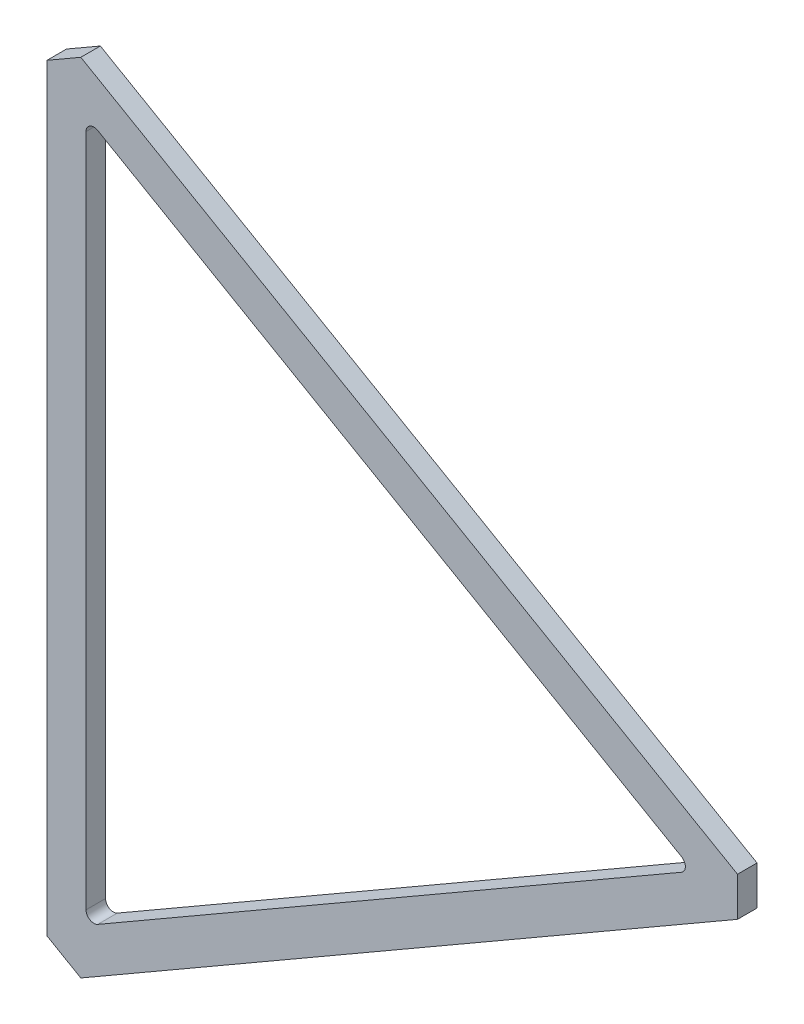
ISO-10303-21;
HEADER;
FILE_DESCRIPTION(('STEP AP214'),'2;1');
FILE_NAME('part.step','',(''),(''),'','','');
FILE_SCHEMA(('AUTOMOTIVE_DESIGN { 1 0 10303 214 1 1 1 1 }'));
ENDSEC;
DATA;
#1=APPLICATION_CONTEXT('core data for automotive mechanical design processes');
#2=APPLICATION_PROTOCOL_DEFINITION('international standard','automotive_design',2000,#1);
#3=PRODUCT_CONTEXT('',#1,'mechanical');
#4=PRODUCT('Part','Part','',(#3));
#5=PRODUCT_RELATED_PRODUCT_CATEGORY('part','',(#4));
#6=PRODUCT_DEFINITION_FORMATION('','',#4);
#7=PRODUCT_DEFINITION_CONTEXT('part definition',#1,'design');
#8=PRODUCT_DEFINITION('design','',#6,#7);
#9=PRODUCT_DEFINITION_SHAPE('','',#8);
#10=(LENGTH_UNIT() NAMED_UNIT(*) SI_UNIT(.MILLI.,.METRE.));
#11=(NAMED_UNIT(*) PLANE_ANGLE_UNIT() SI_UNIT($,.RADIAN.));
#12=(NAMED_UNIT(*) SI_UNIT($,.STERADIAN.) SOLID_ANGLE_UNIT());
#13=UNCERTAINTY_MEASURE_WITH_UNIT(LENGTH_MEASURE(1.E-05),#10,'distance_accuracy_value','');
#14=(GEOMETRIC_REPRESENTATION_CONTEXT(3) GLOBAL_UNCERTAINTY_ASSIGNED_CONTEXT((#13)) GLOBAL_UNIT_ASSIGNED_CONTEXT((#10,
#11,#12)) REPRESENTATION_CONTEXT('',''));
#15=CARTESIAN_POINT('',(0.,0.,0.));
#16=DIRECTION('',(0.,0.,1.));
#17=DIRECTION('',(1.,0.,0.));
#18=AXIS2_PLACEMENT_3D('',#15,#16,#17);
#19=CARTESIAN_POINT('',(0.,0.,-6.35));
#20=DIRECTION('',(0.,0.,1.));
#21=DIRECTION('',(1.,0.,0.));
#22=AXIS2_PLACEMENT_3D('',#19,#20,#21);
#23=PLANE('',#22);
#24=DIRECTION('',(-0.866025403784441,-0.499999999999996,0.));
#25=VECTOR('',#24,1.);
#26=CARTESIAN_POINT('',(-398.132084390221,129.552216057907,-6.35));
#27=LINE('',#26,#25);
#28=CARTESIAN_POINT('',(-398.132084390221,129.552216057907,-6.35));
#29=VERTEX_POINT('',#28);
#30=CARTESIAN_POINT('',(-409.130607018285,123.202216057907,-6.35));
#31=VERTEX_POINT('',#30);
#32=EDGE_CURVE('E179',#29,#31,#27,.T.);
#33=ORIENTED_EDGE('',*,*,#32,.F.);
#34=DIRECTION('',(-0.866025403784437,0.500000000000003,0.));
#35=VECTOR('',#34,1.);
#36=CARTESIAN_POINT('',(-398.132084390221,129.552216057907,-6.35));
#37=LINE('',#36,#35);
#38=CARTESIAN_POINT('',(-184.739586572849,6.35,-6.35));
#39=VERTEX_POINT('',#38);
#40=EDGE_CURVE('E176',#39,#29,#37,.T.);
#41=ORIENTED_EDGE('',*,*,#40,.F.);
#42=DIRECTION('',(0.,1.,0.));
#43=VECTOR('',#42,1.);
#44=CARTESIAN_POINT('',(-184.739586572849,-6.35,-6.35));
#45=LINE('',#44,#43);
#46=CARTESIAN_POINT('',(-184.739586572849,-6.34999999999999,-6.35));
#47=VERTEX_POINT('',#46);
#48=EDGE_CURVE('E171',#47,#39,#45,.T.);
#49=ORIENTED_EDGE('',*,*,#48,.F.);
#50=DIRECTION('',(0.866025403784439,0.5,0.));
#51=VECTOR('',#50,1.);
#52=CARTESIAN_POINT('',(-184.739586572849,-6.35,-6.35));
#53=LINE('',#52,#51);
#54=CARTESIAN_POINT('',(-398.132084390222,-129.552216057907,-6.35));
#55=VERTEX_POINT('',#54);
#56=EDGE_CURVE('E166',#55,#47,#53,.T.);
#57=ORIENTED_EDGE('',*,*,#56,.F.);
#58=DIRECTION('',(0.866025403784441,-0.499999999999996,0.));
#59=VECTOR('',#58,1.);
#60=CARTESIAN_POINT('',(-409.130607018285,-123.202216057906,-6.35));
#61=LINE('',#60,#59);
#62=CARTESIAN_POINT('',(-409.130607018285,-123.202216057906,-6.35));
#63=VERTEX_POINT('',#62);
#64=EDGE_CURVE('E161',#63,#55,#61,.T.);
#65=ORIENTED_EDGE('',*,*,#64,.F.);
#66=DIRECTION('',(0.,1.,0.));
#67=VECTOR('',#66,1.);
#68=CARTESIAN_POINT('',(-409.130607018285,-123.202216057906,-6.35));
#69=LINE('',#68,#67);
#70=EDGE_CURVE('E146',#31,#63,#69,.F.);
#71=ORIENTED_EDGE('',*,*,#70,.F.);
#72=EDGE_LOOP('',(#33,#41,#49,#57,#65,#71));
#73=FACE_BOUND('',#72,.T.);
#74=CARTESIAN_POINT('',(-204.221063944787,1.38777878078145E-13,-6.35));
#75=DIRECTION('',(0.,0.,-1.));
#76=DIRECTION('',(-1.,0.,0.));
#77=AXIS2_PLACEMENT_3D('',#74,#75,#76);
#78=CIRCLE('',#77,2.53999999999999);
#79=CARTESIAN_POINT('',(-202.951063944787,-2.19970452561234,-6.35));
#80=VERTEX_POINT('',#79);
#81=CARTESIAN_POINT('',(-202.951063944787,2.19970452561262,-6.35));
#82=VERTEX_POINT('',#81);
#83=EDGE_CURVE('E131',#80,#82,#78,.F.);
#84=ORIENTED_EDGE('',*,*,#83,.T.);
#85=DIRECTION('',(-0.866025403784439,0.5,0.));
#86=VECTOR('',#85,1.);
#87=CARTESIAN_POINT('',(-396.430607018285,113.905170801782,-6.35));
#88=LINE('',#87,#86);
#89=CARTESIAN_POINT('',(-392.620607018285,111.70546627617,-6.35));
#90=VERTEX_POINT('',#89);
#91=EDGE_CURVE('E117',#82,#90,#88,.T.);
#92=ORIENTED_EDGE('',*,*,#91,.T.);
#93=CARTESIAN_POINT('',(-393.890607018285,109.505761750557,-6.35));
#94=DIRECTION('',(0.,0.,-1.));
#95=DIRECTION('',(-1.,0.,0.));
#96=AXIS2_PLACEMENT_3D('',#93,#94,#95);
#97=CIRCLE('',#96,2.53999999999999);
#98=CARTESIAN_POINT('',(-396.430607018285,109.505761750557,-6.35));
#99=VERTEX_POINT('',#98);
#100=EDGE_CURVE('E19',#90,#99,#97,.F.);
#101=ORIENTED_EDGE('',*,*,#100,.T.);
#102=DIRECTION('',(0.,1.,0.));
#103=VECTOR('',#102,1.);
#104=CARTESIAN_POINT('',(-396.430607018285,-113.905170801782,-6.35));
#105=LINE('',#104,#103);
#106=CARTESIAN_POINT('',(-396.430607018285,-109.505761750557,-6.35));
#107=VERTEX_POINT('',#106);
#108=EDGE_CURVE('E106',#99,#107,#105,.F.);
#109=ORIENTED_EDGE('',*,*,#108,.T.);
#110=CARTESIAN_POINT('',(-393.890607018285,-109.505761750557,-6.35));
#111=DIRECTION('',(0.,0.,-1.));
#112=DIRECTION('',(-1.,0.,0.));
#113=AXIS2_PLACEMENT_3D('',#110,#111,#112);
#114=CIRCLE('',#113,2.53999999999999);
#115=CARTESIAN_POINT('',(-392.620607018285,-111.70546627617,-6.35));
#116=VERTEX_POINT('',#115);
#117=EDGE_CURVE('E145',#107,#116,#114,.F.);
#118=ORIENTED_EDGE('',*,*,#117,.T.);
#119=DIRECTION('',(0.866025403784438,0.500000000000001,0.));
#120=VECTOR('',#119,1.);
#121=CARTESIAN_POINT('',(-199.141063944787,1.37910516340156E-13,-6.35));
#122=LINE('',#121,#120);
#123=EDGE_CURVE('E128',#116,#80,#122,.T.);
#124=ORIENTED_EDGE('',*,*,#123,.T.);
#125=EDGE_LOOP('',(#84,#92,#101,#109,#118,#124));
#126=FACE_BOUND('',#125,.T.);
#127=ADVANCED_FACE('F16',(#73,#126),#23,.F.);
#128=CARTESIAN_POINT('',(-396.430607018285,-113.905170801782,-6.35));
#129=DIRECTION('',(-1.,0.,0.));
#130=DIRECTION('',(0.,0.,1.));
#131=AXIS2_PLACEMENT_3D('',#128,#129,#130);
#132=PLANE('',#131);
#133=DIRECTION('',(0.,0.,-1.));
#134=VECTOR('',#133,1.);
#135=CARTESIAN_POINT('',(-396.430607018285,-109.505761750557,-6.35));
#136=LINE('',#135,#134);
#137=CARTESIAN_POINT('',(-396.430607018285,-109.505761750557,0.));
#138=VERTEX_POINT('',#137);
#139=EDGE_CURVE('E111',#138,#107,#136,.T.);
#140=ORIENTED_EDGE('',*,*,#139,.T.);
#141=ORIENTED_EDGE('',*,*,#108,.F.);
#142=DIRECTION('',(0.,0.,-1.));
#143=VECTOR('',#142,1.);
#144=CARTESIAN_POINT('',(-396.430607018285,109.505761750557,-6.35));
#145=LINE('',#144,#143);
#146=CARTESIAN_POINT('',(-396.430607018285,109.505761750557,0.));
#147=VERTEX_POINT('',#146);
#148=EDGE_CURVE('E108',#99,#147,#145,.F.);
#149=ORIENTED_EDGE('',*,*,#148,.T.);
#150=DIRECTION('',(0.,1.,0.));
#151=VECTOR('',#150,1.);
#152=CARTESIAN_POINT('',(-396.430607018285,0.,0.));
#153=LINE('',#152,#151);
#154=EDGE_CURVE('E144',#138,#147,#153,.T.);
#155=ORIENTED_EDGE('',*,*,#154,.F.);
#156=EDGE_LOOP('',(#140,#141,#149,#155));
#157=FACE_BOUND('',#156,.T.);
#158=ADVANCED_FACE('F107',(#157),#132,.F.);
#159=CARTESIAN_POINT('',(-393.890607018285,109.505761750557,-6.35));
#160=DIRECTION('',(0.,0.,-1.));
#161=DIRECTION('',(-1.,0.,0.));
#162=AXIS2_PLACEMENT_3D('',#159,#160,#161);
#163=CYLINDRICAL_SURFACE('',#162,2.53999999999999);
#164=DIRECTION('',(0.,0.,1.));
#165=VECTOR('',#164,1.);
#166=CARTESIAN_POINT('',(-392.620607018285,111.70546627617,-6.35));
#167=LINE('',#166,#165);
#168=CARTESIAN_POINT('',(-392.620607018285,111.70546627617,0.));
#169=VERTEX_POINT('',#168);
#170=EDGE_CURVE('E119',#90,#169,#167,.T.);
#171=ORIENTED_EDGE('',*,*,#170,.T.);
#172=CARTESIAN_POINT('',(-393.890607018285,109.505761750557,0.));
#173=DIRECTION('',(0.,0.,-1.));
#174=DIRECTION('',(-1.,0.,0.));
#175=AXIS2_PLACEMENT_3D('',#172,#173,#174);
#176=CIRCLE('',#175,2.53999999999999);
#177=EDGE_CURVE('E122',#147,#169,#176,.T.);
#178=ORIENTED_EDGE('',*,*,#177,.F.);
#179=ORIENTED_EDGE('',*,*,#148,.F.);
#180=ORIENTED_EDGE('',*,*,#100,.F.);
#181=EDGE_LOOP('',(#171,#178,#179,#180));
#182=FACE_BOUND('',#181,.T.);
#183=ADVANCED_FACE('F120',(#182),#163,.F.);
#184=CARTESIAN_POINT('',(-396.430607018285,113.905170801782,-6.35));
#185=DIRECTION('',(0.5,0.866025403784439,0.));
#186=DIRECTION('',(-0.866025403784439,0.5,0.));
#187=AXIS2_PLACEMENT_3D('',#184,#185,#186);
#188=PLANE('',#187);
#189=DIRECTION('',(0.,0.,-1.));
#190=VECTOR('',#189,1.);
#191=CARTESIAN_POINT('',(-202.951063944787,2.1997045256126,-6.35));
#192=LINE('',#191,#190);
#193=CARTESIAN_POINT('',(-202.951063944787,2.19970452561261,0.));
#194=VERTEX_POINT('',#193);
#195=EDGE_CURVE('E133',#82,#194,#192,.F.);
#196=ORIENTED_EDGE('',*,*,#195,.T.);
#197=DIRECTION('',(0.866025403784439,-0.5,0.));
#198=VECTOR('',#197,1.);
#199=CARTESIAN_POINT('',(-392.620607018285,111.70546627617,0.));
#200=LINE('',#199,#198);
#201=EDGE_CURVE('E142',#169,#194,#200,.T.);
#202=ORIENTED_EDGE('',*,*,#201,.F.);
#203=ORIENTED_EDGE('',*,*,#170,.F.);
#204=ORIENTED_EDGE('',*,*,#91,.F.);
#205=EDGE_LOOP('',(#196,#202,#203,#204));
#206=FACE_BOUND('',#205,.T.);
#207=ADVANCED_FACE('F313',(#206),#188,.F.);
#208=CARTESIAN_POINT('',(-204.221063944787,1.38777878078145E-13,-6.35));
#209=DIRECTION('',(0.,0.,-1.));
#210=DIRECTION('',(-1.,0.,0.));
#211=AXIS2_PLACEMENT_3D('',#208,#209,#210);
#212=CYLINDRICAL_SURFACE('',#211,2.53999999999999);
#213=DIRECTION('',(0.,0.,1.));
#214=VECTOR('',#213,1.);
#215=CARTESIAN_POINT('',(-202.951063944787,-2.19970452561235,-6.35));
#216=LINE('',#215,#214);
#217=CARTESIAN_POINT('',(-202.951063944787,-2.19970452561234,0.));
#218=VERTEX_POINT('',#217);
#219=EDGE_CURVE('E130',#80,#218,#216,.T.);
#220=ORIENTED_EDGE('',*,*,#219,.T.);
#221=CARTESIAN_POINT('',(-204.221063944787,1.38777878078145E-13,0.));
#222=DIRECTION('',(0.,0.,-1.));
#223=DIRECTION('',(-1.,0.,0.));
#224=AXIS2_PLACEMENT_3D('',#221,#222,#223);
#225=CIRCLE('',#224,2.53999999999999);
#226=EDGE_CURVE('E139',#194,#218,#225,.T.);
#227=ORIENTED_EDGE('',*,*,#226,.F.);
#228=ORIENTED_EDGE('',*,*,#195,.F.);
#229=ORIENTED_EDGE('',*,*,#83,.F.);
#230=EDGE_LOOP('',(#220,#227,#228,#229));
#231=FACE_BOUND('',#230,.T.);
#232=ADVANCED_FACE('F304',(#231),#212,.F.);
#233=CARTESIAN_POINT('',(-199.141063944787,1.37910516340156E-13,-6.35));
#234=DIRECTION('',(0.500000000000001,-0.866025403784438,0.));
#235=DIRECTION('',(0.866025403784438,0.500000000000001,0.));
#236=AXIS2_PLACEMENT_3D('',#233,#234,#235);
#237=PLANE('',#236);
#238=ORIENTED_EDGE('',*,*,#219,.F.);
#239=ORIENTED_EDGE('',*,*,#123,.F.);
#240=DIRECTION('',(0.,0.,-1.));
#241=VECTOR('',#240,1.);
#242=CARTESIAN_POINT('',(-392.620607018285,-111.70546627617,-6.35));
#243=LINE('',#242,#241);
#244=CARTESIAN_POINT('',(-392.620607018285,-111.70546627617,0.));
#245=VERTEX_POINT('',#244);
#246=EDGE_CURVE('E154',#116,#245,#243,.F.);
#247=ORIENTED_EDGE('',*,*,#246,.T.);
#248=DIRECTION('',(-0.866025403784438,-0.500000000000001,0.));
#249=VECTOR('',#248,1.);
#250=CARTESIAN_POINT('',(-202.951063944787,-2.19970452561235,0.));
#251=LINE('',#250,#249);
#252=EDGE_CURVE('E138',#218,#245,#251,.T.);
#253=ORIENTED_EDGE('',*,*,#252,.F.);
#254=EDGE_LOOP('',(#238,#239,#247,#253));
#255=FACE_BOUND('',#254,.T.);
#256=ADVANCED_FACE('F295',(#255),#237,.F.);
#257=CARTESIAN_POINT('',(-393.890607018285,-109.505761750557,-6.35));
#258=DIRECTION('',(0.,0.,-1.));
#259=DIRECTION('',(-1.,0.,0.));
#260=AXIS2_PLACEMENT_3D('',#257,#258,#259);
#261=CYLINDRICAL_SURFACE('',#260,2.53999999999999);
#262=ORIENTED_EDGE('',*,*,#139,.F.);
#263=CARTESIAN_POINT('',(-393.890607018285,-109.505761750557,0.));
#264=DIRECTION('',(0.,0.,-1.));
#265=DIRECTION('',(-1.,0.,0.));
#266=AXIS2_PLACEMENT_3D('',#263,#264,#265);
#267=CIRCLE('',#266,2.53999999999999);
#268=EDGE_CURVE('E134',#245,#138,#267,.T.);
#269=ORIENTED_EDGE('',*,*,#268,.F.);
#270=ORIENTED_EDGE('',*,*,#246,.F.);
#271=ORIENTED_EDGE('',*,*,#117,.F.);
#272=EDGE_LOOP('',(#262,#269,#270,#271));
#273=FACE_BOUND('',#272,.T.);
#274=ADVANCED_FACE('F287',(#273),#261,.F.);
#275=CARTESIAN_POINT('',(-409.130607018285,-123.202216057906,-6.35));
#276=DIRECTION('',(-1.,0.,0.));
#277=DIRECTION('',(0.,0.,1.));
#278=AXIS2_PLACEMENT_3D('',#275,#276,#277);
#279=PLANE('',#278);
#280=ORIENTED_EDGE('',*,*,#70,.T.);
#281=DIRECTION('',(0.,0.,1.));
#282=VECTOR('',#281,1.);
#283=CARTESIAN_POINT('',(-409.130607018285,-123.202216057906,-6.35));
#284=LINE('',#283,#282);
#285=CARTESIAN_POINT('',(-409.130607018285,-123.202216057906,0.));
#286=VERTEX_POINT('',#285);
#287=EDGE_CURVE('E158',#286,#63,#284,.F.);
#288=ORIENTED_EDGE('',*,*,#287,.F.);
#289=DIRECTION('',(0.,1.,0.));
#290=VECTOR('',#289,1.);
#291=CARTESIAN_POINT('',(-409.130607018285,0.,0.));
#292=LINE('',#291,#290);
#293=CARTESIAN_POINT('',(-409.130607018285,123.202216057907,0.));
#294=VERTEX_POINT('',#293);
#295=EDGE_CURVE('E137',#294,#286,#292,.F.);
#296=ORIENTED_EDGE('',*,*,#295,.F.);
#297=DIRECTION('',(0.,0.,1.));
#298=VECTOR('',#297,1.);
#299=CARTESIAN_POINT('',(-409.130607018285,123.202216057907,-6.35));
#300=LINE('',#299,#298);
#301=EDGE_CURVE('E182',#31,#294,#300,.T.);
#302=ORIENTED_EDGE('',*,*,#301,.F.);
#303=EDGE_LOOP('',(#280,#288,#296,#302));
#304=FACE_BOUND('',#303,.T.);
#305=ADVANCED_FACE('F219',(#304),#279,.T.);
#306=CARTESIAN_POINT('',(-409.130607018285,-123.202216057906,-6.35));
#307=DIRECTION('',(-0.499999999999996,-0.866025403784441,0.));
#308=DIRECTION('',(0.866025403784441,-0.499999999999996,0.));
#309=AXIS2_PLACEMENT_3D('',#306,#307,#308);
#310=PLANE('',#309);
#311=ORIENTED_EDGE('',*,*,#64,.T.);
#312=DIRECTION('',(0.,0.,1.));
#313=VECTOR('',#312,1.);
#314=CARTESIAN_POINT('',(-398.132084390222,-129.552216057907,-6.35));
#315=LINE('',#314,#313);
#316=CARTESIAN_POINT('',(-398.132084390222,-129.552216057907,0.));
#317=VERTEX_POINT('',#316);
#318=EDGE_CURVE('E163',#317,#55,#315,.F.);
#319=ORIENTED_EDGE('',*,*,#318,.F.);
#320=DIRECTION('',(0.86602540378444,-0.499999999999998,0.));
#321=VECTOR('',#320,1.);
#322=CARTESIAN_POINT('',(-409.130607018285,-123.202216057906,0.));
#323=LINE('',#322,#321);
#324=EDGE_CURVE('E192',#286,#317,#323,.T.);
#325=ORIENTED_EDGE('',*,*,#324,.F.);
#326=ORIENTED_EDGE('',*,*,#287,.T.);
#327=EDGE_LOOP('',(#311,#319,#325,#326));
#328=FACE_BOUND('',#327,.T.);
#329=ADVANCED_FACE('F223',(#328),#310,.T.);
#330=CARTESIAN_POINT('',(-184.739586572849,-6.35,-6.35));
#331=DIRECTION('',(0.5,-0.866025403784439,0.));
#332=DIRECTION('',(0.866025403784439,0.5,0.));
#333=AXIS2_PLACEMENT_3D('',#330,#331,#332);
#334=PLANE('',#333);
#335=ORIENTED_EDGE('',*,*,#56,.T.);
#336=DIRECTION('',(0.,0.,-1.));
#337=VECTOR('',#336,1.);
#338=CARTESIAN_POINT('',(-184.739586572849,-6.35,-6.35));
#339=LINE('',#338,#337);
#340=CARTESIAN_POINT('',(-184.739586572849,-6.34999999999999,0.));
#341=VERTEX_POINT('',#340);
#342=EDGE_CURVE('E168',#341,#47,#339,.T.);
#343=ORIENTED_EDGE('',*,*,#342,.F.);
#344=DIRECTION('',(0.866025403784438,0.5,0.));
#345=VECTOR('',#344,1.);
#346=CARTESIAN_POINT('',(-398.132084390222,-129.552216057907,0.));
#347=LINE('',#346,#345);
#348=EDGE_CURVE('E195',#317,#341,#347,.T.);
#349=ORIENTED_EDGE('',*,*,#348,.F.);
#350=ORIENTED_EDGE('',*,*,#318,.T.);
#351=EDGE_LOOP('',(#335,#343,#349,#350));
#352=FACE_BOUND('',#351,.T.);
#353=ADVANCED_FACE('F225',(#352),#334,.T.);
#354=CARTESIAN_POINT('',(-184.739586572849,-6.35,-6.35));
#355=DIRECTION('',(1.,0.,0.));
#356=DIRECTION('',(0.,0.,-1.));
#357=AXIS2_PLACEMENT_3D('',#354,#355,#356);
#358=PLANE('',#357);
#359=ORIENTED_EDGE('',*,*,#48,.T.);
#360=DIRECTION('',(0.,0.,1.));
#361=VECTOR('',#360,1.);
#362=CARTESIAN_POINT('',(-184.739586572849,6.34999999999999,-6.35));
#363=LINE('',#362,#361);
#364=CARTESIAN_POINT('',(-184.739586572849,6.35,0.));
#365=VERTEX_POINT('',#364);
#366=EDGE_CURVE('E173',#365,#39,#363,.F.);
#367=ORIENTED_EDGE('',*,*,#366,.F.);
#368=DIRECTION('',(0.,1.,0.));
#369=VECTOR('',#368,1.);
#370=CARTESIAN_POINT('',(-184.739586572849,0.,0.));
#371=LINE('',#370,#369);
#372=EDGE_CURVE('E198',#341,#365,#371,.T.);
#373=ORIENTED_EDGE('',*,*,#372,.F.);
#374=ORIENTED_EDGE('',*,*,#342,.T.);
#375=EDGE_LOOP('',(#359,#367,#373,#374));
#376=FACE_BOUND('',#375,.T.);
#377=ADVANCED_FACE('F210',(#376),#358,.T.);
#378=CARTESIAN_POINT('',(-398.132084390221,129.552216057907,-6.35));
#379=DIRECTION('',(0.500000000000003,0.866025403784437,0.));
#380=DIRECTION('',(-0.866025403784437,0.500000000000003,0.));
#381=AXIS2_PLACEMENT_3D('',#378,#379,#380);
#382=PLANE('',#381);
#383=ORIENTED_EDGE('',*,*,#40,.T.);
#384=DIRECTION('',(0.,0.,1.));
#385=VECTOR('',#384,1.);
#386=CARTESIAN_POINT('',(-398.132084390221,129.552216057907,-6.35));
#387=LINE('',#386,#385);
#388=CARTESIAN_POINT('',(-398.132084390221,129.552216057907,0.));
#389=VERTEX_POINT('',#388);
#390=EDGE_CURVE('E34',#389,#29,#387,.F.);
#391=ORIENTED_EDGE('',*,*,#390,.F.);
#392=DIRECTION('',(-0.866025403784437,0.500000000000003,0.));
#393=VECTOR('',#392,1.);
#394=CARTESIAN_POINT('',(-184.739586572849,6.35,0.));
#395=LINE('',#394,#393);
#396=EDGE_CURVE('E25',#365,#389,#395,.T.);
#397=ORIENTED_EDGE('',*,*,#396,.F.);
#398=ORIENTED_EDGE('',*,*,#366,.T.);
#399=EDGE_LOOP('',(#383,#391,#397,#398));
#400=FACE_BOUND('',#399,.T.);
#401=ADVANCED_FACE('F206',(#400),#382,.T.);
#402=CARTESIAN_POINT('',(-398.132084390221,129.552216057907,-6.35));
#403=DIRECTION('',(-0.499999999999996,0.866025403784441,0.));
#404=DIRECTION('',(-0.866025403784441,-0.499999999999996,0.));
#405=AXIS2_PLACEMENT_3D('',#402,#403,#404);
#406=PLANE('',#405);
#407=ORIENTED_EDGE('',*,*,#32,.T.);
#408=ORIENTED_EDGE('',*,*,#301,.T.);
#409=DIRECTION('',(-0.866025403784441,-0.499999999999996,0.));
#410=VECTOR('',#409,1.);
#411=CARTESIAN_POINT('',(-398.132084390221,129.552216057907,0.));
#412=LINE('',#411,#410);
#413=EDGE_CURVE('E11',#389,#294,#412,.T.);
#414=ORIENTED_EDGE('',*,*,#413,.F.);
#415=ORIENTED_EDGE('',*,*,#390,.T.);
#416=EDGE_LOOP('',(#407,#408,#414,#415));
#417=FACE_BOUND('',#416,.T.);
#418=ADVANCED_FACE('F217',(#417),#406,.T.);
#419=CARTESIAN_POINT('',(0.,0.,0.));
#420=DIRECTION('',(0.,0.,1.));
#421=DIRECTION('',(1.,0.,0.));
#422=AXIS2_PLACEMENT_3D('',#419,#420,#421);
#423=PLANE('',#422);
#424=ORIENTED_EDGE('',*,*,#396,.T.);
#425=ORIENTED_EDGE('',*,*,#413,.T.);
#426=ORIENTED_EDGE('',*,*,#295,.T.);
#427=ORIENTED_EDGE('',*,*,#324,.T.);
#428=ORIENTED_EDGE('',*,*,#348,.T.);
#429=ORIENTED_EDGE('',*,*,#372,.T.);
#430=EDGE_LOOP('',(#424,#425,#426,#427,#428,#429));
#431=FACE_BOUND('',#430,.T.);
#432=ORIENTED_EDGE('',*,*,#252,.T.);
#433=ORIENTED_EDGE('',*,*,#268,.T.);
#434=ORIENTED_EDGE('',*,*,#154,.T.);
#435=ORIENTED_EDGE('',*,*,#177,.T.);
#436=ORIENTED_EDGE('',*,*,#201,.T.);
#437=ORIENTED_EDGE('',*,*,#226,.T.);
#438=EDGE_LOOP('',(#432,#433,#434,#435,#436,#437));
#439=FACE_BOUND('',#438,.T.);
#440=ADVANCED_FACE('F203',(#431,#439),#423,.T.);
#441=CLOSED_SHELL('',(#127,#158,#183,#207,#232,#256,#274,#305,#329,#353,#377,#401,#418,#440));
#442=MANIFOLD_SOLID_BREP('B1',#441);
#443=ADVANCED_BREP_SHAPE_REPRESENTATION('',(#18,#442),#14);
#444=SHAPE_DEFINITION_REPRESENTATION(#9,#443);
ENDSEC;
END-ISO-10303-21;
